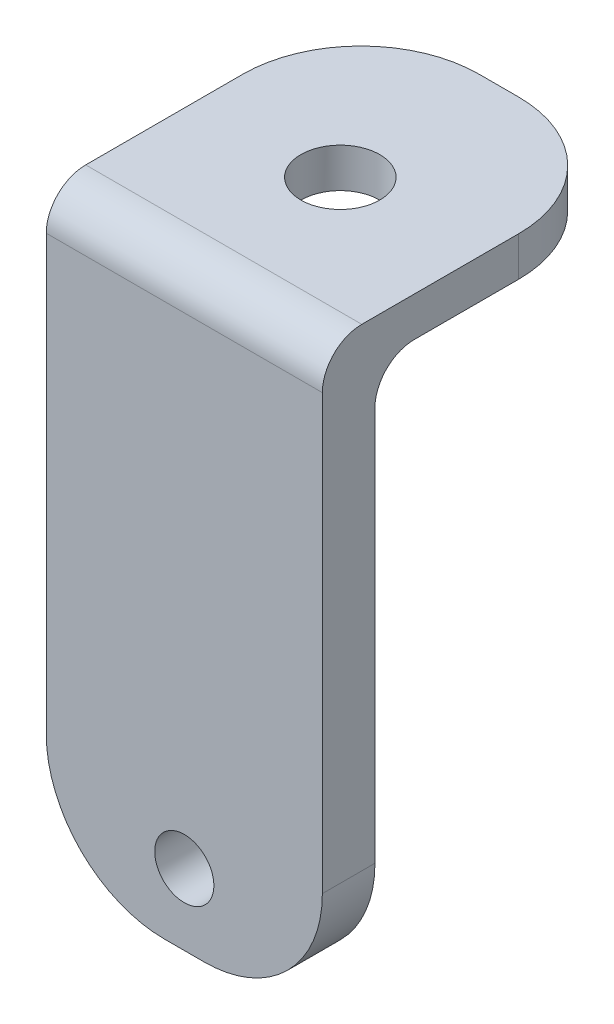
ISO-10303-21;
HEADER;
FILE_DESCRIPTION(('STEP AP214'),'2;1');
FILE_NAME('part.step','',(''),(''),'','','');
FILE_SCHEMA(('AUTOMOTIVE_DESIGN { 1 0 10303 214 1 1 1 1 }'));
ENDSEC;
DATA;
#1=APPLICATION_CONTEXT('core data for automotive mechanical design processes');
#2=APPLICATION_PROTOCOL_DEFINITION('international standard','automotive_design',2000,#1);
#3=PRODUCT_CONTEXT('',#1,'mechanical');
#4=PRODUCT('Part','Part','',(#3));
#5=PRODUCT_RELATED_PRODUCT_CATEGORY('part','',(#4));
#6=PRODUCT_DEFINITION_FORMATION('','',#4);
#7=PRODUCT_DEFINITION_CONTEXT('part definition',#1,'design');
#8=PRODUCT_DEFINITION('design','',#6,#7);
#9=PRODUCT_DEFINITION_SHAPE('','',#8);
#10=(LENGTH_UNIT() NAMED_UNIT(*) SI_UNIT(.MILLI.,.METRE.));
#11=(NAMED_UNIT(*) PLANE_ANGLE_UNIT() SI_UNIT($,.RADIAN.));
#12=(NAMED_UNIT(*) SI_UNIT($,.STERADIAN.) SOLID_ANGLE_UNIT());
#13=UNCERTAINTY_MEASURE_WITH_UNIT(LENGTH_MEASURE(1.E-05),#10,'distance_accuracy_value','');
#14=(GEOMETRIC_REPRESENTATION_CONTEXT(3) GLOBAL_UNCERTAINTY_ASSIGNED_CONTEXT((#13)) GLOBAL_UNIT_ASSIGNED_CONTEXT((#10,
#11,#12)) REPRESENTATION_CONTEXT('',''));
#15=CARTESIAN_POINT('',(0.,0.,0.));
#16=DIRECTION('',(0.,0.,1.));
#17=DIRECTION('',(1.,0.,0.));
#18=AXIS2_PLACEMENT_3D('',#15,#16,#17);
#19=CARTESIAN_POINT('',(-35.,210.217693310135,42.0569210181725));
#20=DIRECTION('',(0.,1.,0.));
#21=DIRECTION('',(0.,0.,1.));
#22=AXIS2_PLACEMENT_3D('',#19,#20,#21);
#23=PLANE('',#22);
#24=CARTESIAN_POINT('',(0.,210.217693310135,2.5));
#25=DIRECTION('',(0.,1.,0.));
#26=DIRECTION('',(0.,0.,1.));
#27=AXIS2_PLACEMENT_3D('',#24,#25,#26);
#28=CIRCLE('',#27,10.);
#29=CARTESIAN_POINT('',(0.,210.217693310135,12.5));
#30=VERTEX_POINT('',#29);
#31=EDGE_CURVE('E166',#30,#30,#28,.T.);
#32=ORIENTED_EDGE('',*,*,#31,.F.);
#33=EDGE_LOOP('',(#32));
#34=FACE_BOUND('',#33,.T.);
#35=DIRECTION('',(0.,0.,1.));
#36=VECTOR('',#35,1.);
#37=CARTESIAN_POINT('',(-35.,210.217693310135,42.0569210181725));
#38=LINE('',#37,#36);
#39=CARTESIAN_POINT('',(-35.,210.217693310135,-7.73203002231183));
#40=VERTEX_POINT('',#39);
#41=CARTESIAN_POINT('',(-35.,210.217693310135,32.0569210181725));
#42=VERTEX_POINT('',#41);
#43=EDGE_CURVE('E155',#40,#42,#38,.T.);
#44=ORIENTED_EDGE('',*,*,#43,.T.);
#45=DIRECTION('',(1.,0.,0.));
#46=VECTOR('',#45,1.);
#47=CARTESIAN_POINT('',(-35.,210.217693310135,32.0569210181725));
#48=LINE('',#47,#46);
#49=CARTESIAN_POINT('',(35.,210.217693310135,32.0569210181725));
#50=VERTEX_POINT('',#49);
#51=EDGE_CURVE('E197',#42,#50,#48,.T.);
#52=ORIENTED_EDGE('',*,*,#51,.T.);
#53=DIRECTION('',(0.,0.,1.));
#54=VECTOR('',#53,1.);
#55=CARTESIAN_POINT('',(35.,210.217693310135,42.0569210181725));
#56=LINE('',#55,#54);
#57=CARTESIAN_POINT('',(35.,210.217693310135,-7.73203002231183));
#58=VERTEX_POINT('',#57);
#59=EDGE_CURVE('E221',#58,#50,#56,.T.);
#60=ORIENTED_EDGE('',*,*,#59,.F.);
#61=CARTESIAN_POINT('',(4.99999999999998,210.217693310135,-7.73203002231183));
#62=DIRECTION('',(0.,1.,0.));
#63=DIRECTION('',(0.,0.,1.));
#64=AXIS2_PLACEMENT_3D('',#61,#62,#63);
#65=CIRCLE('',#64,30.);
#66=CARTESIAN_POINT('',(4.99999999999998,210.217693310135,-37.7320300223118));
#67=VERTEX_POINT('',#66);
#68=EDGE_CURVE('E137',#58,#67,#65,.T.);
#69=ORIENTED_EDGE('',*,*,#68,.T.);
#70=DIRECTION('',(1.,0.,0.));
#71=VECTOR('',#70,1.);
#72=CARTESIAN_POINT('',(-35.,210.217693310135,-37.7320300223118));
#73=LINE('',#72,#71);
#74=CARTESIAN_POINT('',(-5.,210.217693310135,-37.7320300223118));
#75=VERTEX_POINT('',#74);
#76=EDGE_CURVE('E143',#75,#67,#73,.T.);
#77=ORIENTED_EDGE('',*,*,#76,.F.);
#78=CARTESIAN_POINT('',(-5.,210.217693310135,-7.73203002231183));
#79=DIRECTION('',(0.,1.,0.));
#80=DIRECTION('',(0.,0.,1.));
#81=AXIS2_PLACEMENT_3D('',#78,#79,#80);
#82=CIRCLE('',#81,30.);
#83=EDGE_CURVE('E125',#75,#40,#82,.T.);
#84=ORIENTED_EDGE('',*,*,#83,.T.);
#85=EDGE_LOOP('',(#44,#52,#60,#69,#77,#84));
#86=FACE_BOUND('',#85,.T.);
#87=ADVANCED_FACE('F36',(#34,#86),#23,.T.);
#88=CARTESIAN_POINT('',(-35.,210.217693310135,-37.7320300223118));
#89=DIRECTION('',(0.,0.,-1.));
#90=DIRECTION('',(0.,1.,0.));
#91=AXIS2_PLACEMENT_3D('',#88,#89,#90);
#92=PLANE('',#91);
#93=DIRECTION('',(1.,0.,0.));
#94=VECTOR('',#93,1.);
#95=CARTESIAN_POINT('',(-35.,200.217693310135,-37.7320300223118));
#96=LINE('',#95,#94);
#97=CARTESIAN_POINT('',(-5.,200.217693310135,-37.7320300223118));
#98=VERTEX_POINT('',#97);
#99=CARTESIAN_POINT('',(4.99999999999998,200.217693310135,-37.7320300223118));
#100=VERTEX_POINT('',#99);
#101=EDGE_CURVE('E146',#98,#100,#96,.T.);
#102=ORIENTED_EDGE('',*,*,#101,.F.);
#103=DIRECTION('',(0.,1.,0.));
#104=VECTOR('',#103,1.);
#105=CARTESIAN_POINT('',(-5.,210.217693310135,-37.7320300223118));
#106=LINE('',#105,#104);
#107=EDGE_CURVE('E129',#98,#75,#106,.T.);
#108=ORIENTED_EDGE('',*,*,#107,.T.);
#109=ORIENTED_EDGE('',*,*,#76,.T.);
#110=DIRECTION('',(0.,1.,0.));
#111=VECTOR('',#110,1.);
#112=CARTESIAN_POINT('',(4.99999999999998,210.217693310135,-37.7320300223118));
#113=LINE('',#112,#111);
#114=EDGE_CURVE('E147',#67,#100,#113,.F.);
#115=ORIENTED_EDGE('',*,*,#114,.T.);
#116=EDGE_LOOP('',(#102,#108,#109,#115));
#117=FACE_BOUND('',#116,.T.);
#118=ADVANCED_FACE('F142',(#117),#92,.T.);
#119=CARTESIAN_POINT('',(-35.,200.217693310135,28.7170376465665));
#120=DIRECTION('',(0.,-1.,0.));
#121=DIRECTION('',(0.,0.,-1.));
#122=AXIS2_PLACEMENT_3D('',#119,#120,#121);
#123=PLANE('',#122);
#124=CARTESIAN_POINT('',(0.,200.217693310135,2.5));
#125=DIRECTION('',(0.,-1.,0.));
#126=DIRECTION('',(0.,0.,-1.));
#127=AXIS2_PLACEMENT_3D('',#124,#125,#126);
#128=CIRCLE('',#127,10.);
#129=CARTESIAN_POINT('',(0.,200.217693310135,-7.5));
#130=VERTEX_POINT('',#129);
#131=EDGE_CURVE('E163',#130,#130,#128,.T.);
#132=ORIENTED_EDGE('',*,*,#131,.F.);
#133=EDGE_LOOP('',(#132));
#134=FACE_BOUND('',#133,.T.);
#135=DIRECTION('',(0.,0.,-1.));
#136=VECTOR('',#135,1.);
#137=CARTESIAN_POINT('',(35.,200.217693310135,28.7170376465665));
#138=LINE('',#137,#136);
#139=CARTESIAN_POINT('',(35.,200.217693310135,18.7170376465665));
#140=VERTEX_POINT('',#139);
#141=CARTESIAN_POINT('',(35.,200.217693310135,-7.73203002231183));
#142=VERTEX_POINT('',#141);
#143=EDGE_CURVE('E213',#140,#142,#138,.T.);
#144=ORIENTED_EDGE('',*,*,#143,.F.);
#145=DIRECTION('',(1.,0.,0.));
#146=VECTOR('',#145,1.);
#147=CARTESIAN_POINT('',(-35.,200.217693310135,18.7170376465665));
#148=LINE('',#147,#146);
#149=CARTESIAN_POINT('',(-35.,200.217693310135,18.7170376465665));
#150=VERTEX_POINT('',#149);
#151=EDGE_CURVE('E57',#140,#150,#148,.F.);
#152=ORIENTED_EDGE('',*,*,#151,.T.);
#153=DIRECTION('',(0.,0.,-1.));
#154=VECTOR('',#153,1.);
#155=CARTESIAN_POINT('',(-35.,200.217693310135,28.7170376465665));
#156=LINE('',#155,#154);
#157=CARTESIAN_POINT('',(-35.,200.217693310135,-7.73203002231183));
#158=VERTEX_POINT('',#157);
#159=EDGE_CURVE('E228',#150,#158,#156,.T.);
#160=ORIENTED_EDGE('',*,*,#159,.T.);
#161=CARTESIAN_POINT('',(-5.,200.217693310135,-7.73203002231183));
#162=DIRECTION('',(0.,-1.,0.));
#163=DIRECTION('',(0.,0.,-1.));
#164=AXIS2_PLACEMENT_3D('',#161,#162,#163);
#165=CIRCLE('',#164,30.);
#166=EDGE_CURVE('E175',#158,#98,#165,.T.);
#167=ORIENTED_EDGE('',*,*,#166,.T.);
#168=ORIENTED_EDGE('',*,*,#101,.T.);
#169=CARTESIAN_POINT('',(4.99999999999998,200.217693310135,-7.73203002231183));
#170=DIRECTION('',(0.,-1.,0.));
#171=DIRECTION('',(0.,0.,-1.));
#172=AXIS2_PLACEMENT_3D('',#169,#170,#171);
#173=CIRCLE('',#172,30.);
#174=EDGE_CURVE('E172',#100,#142,#173,.T.);
#175=ORIENTED_EDGE('',*,*,#174,.T.);
#176=EDGE_LOOP('',(#144,#152,#160,#167,#168,#175));
#177=FACE_BOUND('',#176,.T.);
#178=ADVANCED_FACE('F218',(#134,#177),#123,.T.);
#179=CARTESIAN_POINT('',(-35.,60.2176933101346,28.7170376465665));
#180=DIRECTION('',(0.,0.,-1.));
#181=DIRECTION('',(-1.,0.,0.));
#182=AXIS2_PLACEMENT_3D('',#179,#180,#181);
#183=PLANE('',#182);
#184=CARTESIAN_POINT('',(0.,78.2176933101346,28.7170376465665));
#185=DIRECTION('',(0.,0.,-1.));
#186=DIRECTION('',(-1.,0.,0.));
#187=AXIS2_PLACEMENT_3D('',#184,#185,#186);
#188=CIRCLE('',#187,7.50000000000001);
#189=CARTESIAN_POINT('',(-7.5,78.2176933101346,28.7170376465665));
#190=VERTEX_POINT('',#189);
#191=EDGE_CURVE('E238',#190,#190,#188,.T.);
#192=ORIENTED_EDGE('',*,*,#191,.F.);
#193=EDGE_LOOP('',(#192));
#194=FACE_BOUND('',#193,.T.);
#195=DIRECTION('',(0.,1.,0.));
#196=VECTOR('',#195,1.);
#197=CARTESIAN_POINT('',(-35.,60.2176933101346,28.7170376465665));
#198=LINE('',#197,#196);
#199=CARTESIAN_POINT('',(-35.,90.2176933101346,28.7170376465665));
#200=VERTEX_POINT('',#199);
#201=CARTESIAN_POINT('',(-35.,190.217693310135,28.7170376465665));
#202=VERTEX_POINT('',#201);
#203=EDGE_CURVE('E225',#200,#202,#198,.T.);
#204=ORIENTED_EDGE('',*,*,#203,.T.);
#205=DIRECTION('',(1.,0.,0.));
#206=VECTOR('',#205,1.);
#207=CARTESIAN_POINT('',(35.,190.217693310135,28.7170376465665));
#208=LINE('',#207,#206);
#209=CARTESIAN_POINT('',(35.,190.217693310135,28.7170376465665));
#210=VERTEX_POINT('',#209);
#211=EDGE_CURVE('E206',#202,#210,#208,.T.);
#212=ORIENTED_EDGE('',*,*,#211,.T.);
#213=DIRECTION('',(0.,1.,0.));
#214=VECTOR('',#213,1.);
#215=CARTESIAN_POINT('',(35.,60.2176933101346,28.7170376465665));
#216=LINE('',#215,#214);
#217=CARTESIAN_POINT('',(35.,90.2176933101346,28.7170376465665));
#218=VERTEX_POINT('',#217);
#219=EDGE_CURVE('E215',#218,#210,#216,.T.);
#220=ORIENTED_EDGE('',*,*,#219,.F.);
#221=CARTESIAN_POINT('',(4.99999999999998,90.2176933101346,28.7170376465665));
#222=DIRECTION('',(0.,0.,-1.));
#223=DIRECTION('',(-1.,0.,0.));
#224=AXIS2_PLACEMENT_3D('',#221,#222,#223);
#225=CIRCLE('',#224,30.);
#226=CARTESIAN_POINT('',(4.99999999999998,60.2176933101346,28.7170376465665));
#227=VERTEX_POINT('',#226);
#228=EDGE_CURVE('E188',#218,#227,#225,.T.);
#229=ORIENTED_EDGE('',*,*,#228,.T.);
#230=DIRECTION('',(1.,0.,0.));
#231=VECTOR('',#230,1.);
#232=CARTESIAN_POINT('',(-35.,60.2176933101346,28.7170376465665));
#233=LINE('',#232,#231);
#234=CARTESIAN_POINT('',(-5.,60.2176933101346,28.7170376465665));
#235=VERTEX_POINT('',#234);
#236=EDGE_CURVE('E152',#235,#227,#233,.T.);
#237=ORIENTED_EDGE('',*,*,#236,.F.);
#238=CARTESIAN_POINT('',(-5.,90.2176933101346,28.7170376465665));
#239=DIRECTION('',(0.,0.,-1.));
#240=DIRECTION('',(-1.,0.,0.));
#241=AXIS2_PLACEMENT_3D('',#238,#239,#240);
#242=CIRCLE('',#241,30.);
#243=EDGE_CURVE('E190',#235,#200,#242,.T.);
#244=ORIENTED_EDGE('',*,*,#243,.T.);
#245=EDGE_LOOP('',(#204,#212,#220,#229,#237,#244));
#246=FACE_BOUND('',#245,.T.);
#247=ADVANCED_FACE('F224',(#194,#246),#183,.T.);
#248=CARTESIAN_POINT('',(-35.,60.2176933101346,42.0569210181725));
#249=DIRECTION('',(0.,-1.,0.));
#250=DIRECTION('',(0.,0.,-1.));
#251=AXIS2_PLACEMENT_3D('',#248,#249,#250);
#252=PLANE('',#251);
#253=DIRECTION('',(1.,0.,0.));
#254=VECTOR('',#253,1.);
#255=CARTESIAN_POINT('',(-35.,60.2176933101346,42.0569210181725));
#256=LINE('',#255,#254);
#257=CARTESIAN_POINT('',(-5.,60.2176933101346,42.0569210181725));
#258=VERTEX_POINT('',#257);
#259=CARTESIAN_POINT('',(4.99999999999998,60.2176933101346,42.0569210181725));
#260=VERTEX_POINT('',#259);
#261=EDGE_CURVE('E160',#258,#260,#256,.T.);
#262=ORIENTED_EDGE('',*,*,#261,.F.);
#263=DIRECTION('',(0.,0.,-1.));
#264=VECTOR('',#263,1.);
#265=CARTESIAN_POINT('',(-5.,60.2176933101346,28.7170376465665));
#266=LINE('',#265,#264);
#267=EDGE_CURVE('E185',#258,#235,#266,.T.);
#268=ORIENTED_EDGE('',*,*,#267,.T.);
#269=ORIENTED_EDGE('',*,*,#236,.T.);
#270=DIRECTION('',(0.,0.,-1.));
#271=VECTOR('',#270,1.);
#272=CARTESIAN_POINT('',(4.99999999999998,60.2176933101346,42.0569210181725));
#273=LINE('',#272,#271);
#274=EDGE_CURVE('E183',#227,#260,#273,.F.);
#275=ORIENTED_EDGE('',*,*,#274,.T.);
#276=EDGE_LOOP('',(#262,#268,#269,#275));
#277=FACE_BOUND('',#276,.T.);
#278=ADVANCED_FACE('F251',(#277),#252,.T.);
#279=CARTESIAN_POINT('',(-35.,166.399972685061,42.0569210181725));
#280=DIRECTION('',(0.,0.,1.));
#281=DIRECTION('',(1.,0.,0.));
#282=AXIS2_PLACEMENT_3D('',#279,#280,#281);
#283=PLANE('',#282);
#284=CARTESIAN_POINT('',(0.,78.2176933101346,42.0569210181725));
#285=DIRECTION('',(0.,0.,1.));
#286=DIRECTION('',(1.,0.,0.));
#287=AXIS2_PLACEMENT_3D('',#284,#285,#286);
#288=CIRCLE('',#287,7.50000000000001);
#289=CARTESIAN_POINT('',(7.50000000000001,78.2176933101346,42.0569210181725));
#290=VERTEX_POINT('',#289);
#291=EDGE_CURVE('E241',#290,#290,#288,.T.);
#292=ORIENTED_EDGE('',*,*,#291,.F.);
#293=EDGE_LOOP('',(#292));
#294=FACE_BOUND('',#293,.T.);
#295=DIRECTION('',(0.,-1.,0.));
#296=VECTOR('',#295,1.);
#297=CARTESIAN_POINT('',(35.,210.217693310135,42.0569210181725));
#298=LINE('',#297,#296);
#299=CARTESIAN_POINT('',(35.,200.217693310135,42.0569210181725));
#300=VERTEX_POINT('',#299);
#301=CARTESIAN_POINT('',(35.,90.2176933101346,42.0569210181725));
#302=VERTEX_POINT('',#301);
#303=EDGE_CURVE('E165',#300,#302,#298,.T.);
#304=ORIENTED_EDGE('',*,*,#303,.F.);
#305=DIRECTION('',(1.,0.,0.));
#306=VECTOR('',#305,1.);
#307=CARTESIAN_POINT('',(-35.,200.217693310135,42.0569210181725));
#308=LINE('',#307,#306);
#309=CARTESIAN_POINT('',(-35.,200.217693310135,42.0569210181725));
#310=VERTEX_POINT('',#309);
#311=EDGE_CURVE('E202',#300,#310,#308,.F.);
#312=ORIENTED_EDGE('',*,*,#311,.T.);
#313=DIRECTION('',(0.,-1.,0.));
#314=VECTOR('',#313,1.);
#315=CARTESIAN_POINT('',(-35.,210.217693310135,42.0569210181725));
#316=LINE('',#315,#314);
#317=CARTESIAN_POINT('',(-35.,90.2176933101346,42.0569210181725));
#318=VERTEX_POINT('',#317);
#319=EDGE_CURVE('E229',#310,#318,#316,.T.);
#320=ORIENTED_EDGE('',*,*,#319,.T.);
#321=CARTESIAN_POINT('',(-5.,90.2176933101346,42.0569210181725));
#322=DIRECTION('',(0.,0.,1.));
#323=DIRECTION('',(1.,0.,0.));
#324=AXIS2_PLACEMENT_3D('',#321,#322,#323);
#325=CIRCLE('',#324,30.);
#326=EDGE_CURVE('E195',#318,#258,#325,.T.);
#327=ORIENTED_EDGE('',*,*,#326,.T.);
#328=ORIENTED_EDGE('',*,*,#261,.T.);
#329=CARTESIAN_POINT('',(4.99999999999998,90.2176933101346,42.0569210181725));
#330=DIRECTION('',(0.,0.,1.));
#331=DIRECTION('',(1.,0.,0.));
#332=AXIS2_PLACEMENT_3D('',#329,#330,#331);
#333=CIRCLE('',#332,30.);
#334=EDGE_CURVE('E192',#260,#302,#333,.T.);
#335=ORIENTED_EDGE('',*,*,#334,.T.);
#336=EDGE_LOOP('',(#304,#312,#320,#327,#328,#335));
#337=FACE_BOUND('',#336,.T.);
#338=ADVANCED_FACE('F247',(#294,#337),#283,.T.);
#339=CARTESIAN_POINT('',(-35.,0.,0.));
#340=DIRECTION('',(1.,0.,0.));
#341=DIRECTION('',(0.,0.,-1.));
#342=AXIS2_PLACEMENT_3D('',#339,#340,#341);
#343=PLANE('',#342);
#344=ORIENTED_EDGE('',*,*,#319,.F.);
#345=CARTESIAN_POINT('',(-35.,200.217693310135,32.0569210181725));
#346=DIRECTION('',(1.,0.,0.));
#347=DIRECTION('',(0.,0.,-1.));
#348=AXIS2_PLACEMENT_3D('',#345,#346,#347);
#349=CIRCLE('',#348,10.);
#350=EDGE_CURVE('E204',#310,#42,#349,.F.);
#351=ORIENTED_EDGE('',*,*,#350,.T.);
#352=ORIENTED_EDGE('',*,*,#43,.F.);
#353=DIRECTION('',(0.,1.,0.));
#354=VECTOR('',#353,1.);
#355=CARTESIAN_POINT('',(-35.,200.217693310135,-7.73203002231183));
#356=LINE('',#355,#354);
#357=EDGE_CURVE('E131',#40,#158,#356,.F.);
#358=ORIENTED_EDGE('',*,*,#357,.T.);
#359=ORIENTED_EDGE('',*,*,#159,.F.);
#360=CARTESIAN_POINT('',(-35.,190.217693310135,18.7170376465665));
#361=DIRECTION('',(1.,0.,0.));
#362=DIRECTION('',(0.,0.,-1.));
#363=AXIS2_PLACEMENT_3D('',#360,#361,#362);
#364=CIRCLE('',#363,10.);
#365=EDGE_CURVE('E11',#150,#202,#364,.T.);
#366=ORIENTED_EDGE('',*,*,#365,.T.);
#367=ORIENTED_EDGE('',*,*,#203,.F.);
#368=DIRECTION('',(0.,0.,-1.));
#369=VECTOR('',#368,1.);
#370=CARTESIAN_POINT('',(-35.,90.2176933101346,42.0569210181725));
#371=LINE('',#370,#369);
#372=EDGE_CURVE('E136',#200,#318,#371,.F.);
#373=ORIENTED_EDGE('',*,*,#372,.T.);
#374=EDGE_LOOP('',(#344,#351,#352,#358,#359,#366,#367,#373));
#375=FACE_BOUND('',#374,.T.);
#376=ADVANCED_FACE('F250',(#375),#343,.F.);
#377=CARTESIAN_POINT('',(35.,0.,0.));
#378=DIRECTION('',(1.,0.,0.));
#379=DIRECTION('',(0.,0.,-1.));
#380=AXIS2_PLACEMENT_3D('',#377,#378,#379);
#381=PLANE('',#380);
#382=ORIENTED_EDGE('',*,*,#59,.T.);
#383=CARTESIAN_POINT('',(35.,200.217693310135,32.0569210181725));
#384=DIRECTION('',(1.,0.,0.));
#385=DIRECTION('',(0.,0.,-1.));
#386=AXIS2_PLACEMENT_3D('',#383,#384,#385);
#387=CIRCLE('',#386,10.);
#388=EDGE_CURVE('E200',#50,#300,#387,.T.);
#389=ORIENTED_EDGE('',*,*,#388,.T.);
#390=ORIENTED_EDGE('',*,*,#303,.T.);
#391=DIRECTION('',(0.,0.,-1.));
#392=VECTOR('',#391,1.);
#393=CARTESIAN_POINT('',(35.,90.2176933101346,0.));
#394=LINE('',#393,#392);
#395=EDGE_CURVE('E177',#302,#218,#394,.T.);
#396=ORIENTED_EDGE('',*,*,#395,.T.);
#397=ORIENTED_EDGE('',*,*,#219,.T.);
#398=CARTESIAN_POINT('',(35.,190.217693310135,18.7170376465665));
#399=DIRECTION('',(1.,0.,0.));
#400=DIRECTION('',(0.,0.,-1.));
#401=AXIS2_PLACEMENT_3D('',#398,#399,#400);
#402=CIRCLE('',#401,10.);
#403=EDGE_CURVE('E44',#210,#140,#402,.F.);
#404=ORIENTED_EDGE('',*,*,#403,.T.);
#405=ORIENTED_EDGE('',*,*,#143,.T.);
#406=DIRECTION('',(0.,1.,0.));
#407=VECTOR('',#406,1.);
#408=CARTESIAN_POINT('',(35.,0.,-7.73203002231169));
#409=LINE('',#408,#407);
#410=EDGE_CURVE('E180',#142,#58,#409,.T.);
#411=ORIENTED_EDGE('',*,*,#410,.T.);
#412=EDGE_LOOP('',(#382,#389,#390,#396,#397,#404,#405,#411));
#413=FACE_BOUND('',#412,.T.);
#414=ADVANCED_FACE('F212',(#413),#381,.T.);
#415=CARTESIAN_POINT('',(0.,175.217693310135,2.5));
#416=DIRECTION('',(0.,1.,0.));
#417=DIRECTION('',(0.,0.,1.));
#418=AXIS2_PLACEMENT_3D('',#415,#416,#417);
#419=CYLINDRICAL_SURFACE('',#418,10.);
#420=ORIENTED_EDGE('',*,*,#131,.T.);
#421=EDGE_LOOP('',(#420));
#422=FACE_BOUND('',#421,.T.);
#423=ORIENTED_EDGE('',*,*,#31,.T.);
#424=EDGE_LOOP('',(#423));
#425=FACE_BOUND('',#424,.T.);
#426=ADVANCED_FACE('F325',(#422,#425),#419,.F.);
#427=CARTESIAN_POINT('',(0.,78.2176933101346,-37.7320300223118));
#428=DIRECTION('',(0.,0.,1.));
#429=DIRECTION('',(1.,0.,0.));
#430=AXIS2_PLACEMENT_3D('',#427,#428,#429);
#431=CYLINDRICAL_SURFACE('',#430,7.50000000000001);
#432=ORIENTED_EDGE('',*,*,#191,.T.);
#433=EDGE_LOOP('',(#432));
#434=FACE_BOUND('',#433,.T.);
#435=ORIENTED_EDGE('',*,*,#291,.T.);
#436=EDGE_LOOP('',(#435));
#437=FACE_BOUND('',#436,.T.);
#438=ADVANCED_FACE('F245',(#434,#437),#431,.F.);
#439=CARTESIAN_POINT('',(-5.,210.217693310135,-7.73203002231183));
#440=DIRECTION('',(0.,-1.,0.));
#441=DIRECTION('',(0.,0.,-1.));
#442=AXIS2_PLACEMENT_3D('',#439,#440,#441);
#443=CYLINDRICAL_SURFACE('',#442,30.);
#444=ORIENTED_EDGE('',*,*,#166,.F.);
#445=ORIENTED_EDGE('',*,*,#357,.F.);
#446=ORIENTED_EDGE('',*,*,#83,.F.);
#447=ORIENTED_EDGE('',*,*,#107,.F.);
#448=EDGE_LOOP('',(#444,#445,#446,#447));
#449=FACE_BOUND('',#448,.T.);
#450=ADVANCED_FACE('F128',(#449),#443,.T.);
#451=CARTESIAN_POINT('',(4.99999999999998,0.,-7.73203002231169));
#452=DIRECTION('',(0.,1.,0.));
#453=DIRECTION('',(0.,0.,1.));
#454=AXIS2_PLACEMENT_3D('',#451,#452,#453);
#455=CYLINDRICAL_SURFACE('',#454,30.);
#456=ORIENTED_EDGE('',*,*,#174,.F.);
#457=ORIENTED_EDGE('',*,*,#114,.F.);
#458=ORIENTED_EDGE('',*,*,#68,.F.);
#459=ORIENTED_EDGE('',*,*,#410,.F.);
#460=EDGE_LOOP('',(#456,#457,#458,#459));
#461=FACE_BOUND('',#460,.T.);
#462=ADVANCED_FACE('F263',(#461),#455,.T.);
#463=CARTESIAN_POINT('',(-5.,90.2176933101346,42.0569210181725));
#464=DIRECTION('',(0.,0.,1.));
#465=DIRECTION('',(1.,0.,0.));
#466=AXIS2_PLACEMENT_3D('',#463,#464,#465);
#467=CYLINDRICAL_SURFACE('',#466,30.);
#468=ORIENTED_EDGE('',*,*,#326,.F.);
#469=ORIENTED_EDGE('',*,*,#372,.F.);
#470=ORIENTED_EDGE('',*,*,#243,.F.);
#471=ORIENTED_EDGE('',*,*,#267,.F.);
#472=EDGE_LOOP('',(#468,#469,#470,#471));
#473=FACE_BOUND('',#472,.T.);
#474=ADVANCED_FACE('F265',(#473),#467,.T.);
#475=CARTESIAN_POINT('',(4.99999999999998,90.2176933101346,0.));
#476=DIRECTION('',(0.,0.,-1.));
#477=DIRECTION('',(-1.,0.,0.));
#478=AXIS2_PLACEMENT_3D('',#475,#476,#477);
#479=CYLINDRICAL_SURFACE('',#478,30.);
#480=ORIENTED_EDGE('',*,*,#334,.F.);
#481=ORIENTED_EDGE('',*,*,#274,.F.);
#482=ORIENTED_EDGE('',*,*,#228,.F.);
#483=ORIENTED_EDGE('',*,*,#395,.F.);
#484=EDGE_LOOP('',(#480,#481,#482,#483));
#485=FACE_BOUND('',#484,.T.);
#486=ADVANCED_FACE('F271',(#485),#479,.T.);
#487=CARTESIAN_POINT('',(-35.,200.217693310135,32.0569210181725));
#488=DIRECTION('',(1.,0.,0.));
#489=DIRECTION('',(0.,0.,-1.));
#490=AXIS2_PLACEMENT_3D('',#487,#488,#489);
#491=CYLINDRICAL_SURFACE('',#490,10.);
#492=ORIENTED_EDGE('',*,*,#350,.F.);
#493=ORIENTED_EDGE('',*,*,#311,.F.);
#494=ORIENTED_EDGE('',*,*,#388,.F.);
#495=ORIENTED_EDGE('',*,*,#51,.F.);
#496=EDGE_LOOP('',(#492,#493,#494,#495));
#497=FACE_BOUND('',#496,.T.);
#498=ADVANCED_FACE('F260',(#497),#491,.T.);
#499=CARTESIAN_POINT('',(-35.,190.217693310135,18.7170376465665));
#500=DIRECTION('',(-1.,0.,0.));
#501=DIRECTION('',(0.,0.,1.));
#502=AXIS2_PLACEMENT_3D('',#499,#500,#501);
#503=CYLINDRICAL_SURFACE('',#502,10.);
#504=ORIENTED_EDGE('',*,*,#365,.F.);
#505=ORIENTED_EDGE('',*,*,#151,.F.);
#506=ORIENTED_EDGE('',*,*,#403,.F.);
#507=ORIENTED_EDGE('',*,*,#211,.F.);
#508=EDGE_LOOP('',(#504,#505,#506,#507));
#509=FACE_BOUND('',#508,.T.);
#510=ADVANCED_FACE('F38',(#509),#503,.F.);
#511=CLOSED_SHELL('',(#87,#118,#178,#247,#278,#338,#376,#414,#426,#438,#450,#462,#474,#486,#498,#510));
#512=MANIFOLD_SOLID_BREP('B2',#511);
#513=ADVANCED_BREP_SHAPE_REPRESENTATION('',(#18,#512),#14);
#514=SHAPE_DEFINITION_REPRESENTATION(#9,#513);
ENDSEC;
END-ISO-10303-21;
